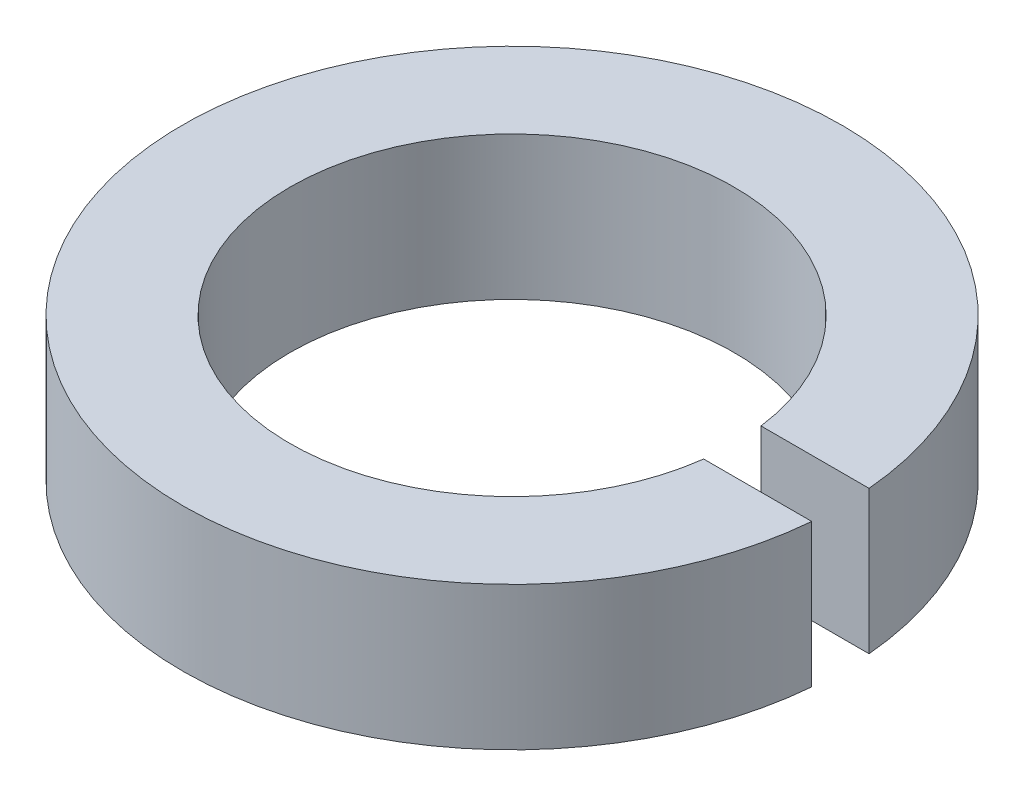
ISO-10303-21;
HEADER;
FILE_DESCRIPTION(('STEP AP214'),'2;1');
FILE_NAME('part.step','',(''),(''),'','','');
FILE_SCHEMA(('AUTOMOTIVE_DESIGN { 1 0 10303 214 1 1 1 1 }'));
ENDSEC;
DATA;
#1=APPLICATION_CONTEXT('core data for automotive mechanical design processes');
#2=APPLICATION_PROTOCOL_DEFINITION('international standard','automotive_design',2000,#1);
#3=PRODUCT_CONTEXT('',#1,'mechanical');
#4=PRODUCT('Part','Part','',(#3));
#5=PRODUCT_RELATED_PRODUCT_CATEGORY('part','',(#4));
#6=PRODUCT_DEFINITION_FORMATION('','',#4);
#7=PRODUCT_DEFINITION_CONTEXT('part definition',#1,'design');
#8=PRODUCT_DEFINITION('design','',#6,#7);
#9=PRODUCT_DEFINITION_SHAPE('','',#8);
#10=(LENGTH_UNIT() NAMED_UNIT(*) SI_UNIT(.MILLI.,.METRE.));
#11=(NAMED_UNIT(*) PLANE_ANGLE_UNIT() SI_UNIT($,.RADIAN.));
#12=(NAMED_UNIT(*) SI_UNIT($,.STERADIAN.) SOLID_ANGLE_UNIT());
#13=UNCERTAINTY_MEASURE_WITH_UNIT(LENGTH_MEASURE(1.E-05),#10,'distance_accuracy_value','');
#14=(GEOMETRIC_REPRESENTATION_CONTEXT(3) GLOBAL_UNCERTAINTY_ASSIGNED_CONTEXT((#13)) GLOBAL_UNIT_ASSIGNED_CONTEXT((#10,
#11,#12)) REPRESENTATION_CONTEXT('',''));
#15=CARTESIAN_POINT('',(0.,0.,0.));
#16=DIRECTION('',(0.,0.,1.));
#17=DIRECTION('',(1.,0.,0.));
#18=AXIS2_PLACEMENT_3D('',#15,#16,#17);
#19=CARTESIAN_POINT('',(0.,0.,0.));
#20=DIRECTION('',(0.,1.,0.));
#21=DIRECTION('',(0.,0.,1.));
#22=AXIS2_PLACEMENT_3D('',#19,#20,#21);
#23=PLANE('',#22);
#24=DIRECTION('',(-1.,0.,0.));
#25=VECTOR('',#24,1.);
#26=CARTESIAN_POINT('',(1.,0.,-0.2));
#27=LINE('',#26,#25);
#28=CARTESIAN_POINT('',(2.29128784747792,0.,-0.2));
#29=VERTEX_POINT('',#28);
#30=CARTESIAN_POINT('',(1.53704261489394,0.,-0.2));
#31=VERTEX_POINT('',#30);
#32=EDGE_CURVE('E59',#29,#31,#27,.T.);
#33=ORIENTED_EDGE('',*,*,#32,.T.);
#34=CARTESIAN_POINT('',(0.,0.,0.));
#35=DIRECTION('',(0.,-1.,0.));
#36=DIRECTION('',(0.,0.,-1.));
#37=AXIS2_PLACEMENT_3D('',#34,#35,#36);
#38=CIRCLE('',#37,1.55);
#39=CARTESIAN_POINT('',(1.53704261489394,0.,0.2));
#40=VERTEX_POINT('',#39);
#41=EDGE_CURVE('E82',#31,#40,#38,.F.);
#42=ORIENTED_EDGE('',*,*,#41,.T.);
#43=DIRECTION('',(1.,0.,0.));
#44=VECTOR('',#43,1.);
#45=CARTESIAN_POINT('',(1.,0.,0.2));
#46=LINE('',#45,#44);
#47=CARTESIAN_POINT('',(2.29128784747792,0.,0.2));
#48=VERTEX_POINT('',#47);
#49=EDGE_CURVE('E61',#40,#48,#46,.T.);
#50=ORIENTED_EDGE('',*,*,#49,.T.);
#51=CARTESIAN_POINT('',(0.,0.,0.));
#52=DIRECTION('',(0.,-1.,0.));
#53=DIRECTION('',(0.,0.,-1.));
#54=AXIS2_PLACEMENT_3D('',#51,#52,#53);
#55=CIRCLE('',#54,2.3);
#56=EDGE_CURVE('E20',#29,#48,#55,.F.);
#57=ORIENTED_EDGE('',*,*,#56,.F.);
#58=EDGE_LOOP('',(#33,#42,#50,#57));
#59=FACE_BOUND('',#58,.T.);
#60=ADVANCED_FACE('F17',(#59),#23,.F.);
#61=CARTESIAN_POINT('',(1.,0.,-0.2));
#62=DIRECTION('',(0.,0.,-1.));
#63=DIRECTION('',(-1.,0.,0.));
#64=AXIS2_PLACEMENT_3D('',#61,#62,#63);
#65=PLANE('',#64);
#66=DIRECTION('',(0.,-1.,0.));
#67=VECTOR('',#66,1.);
#68=CARTESIAN_POINT('',(1.53704261489394,1.,-0.2));
#69=LINE('',#68,#67);
#70=CARTESIAN_POINT('',(1.53704261489394,1.,-0.2));
#71=VERTEX_POINT('',#70);
#72=EDGE_CURVE('E70',#71,#31,#69,.T.);
#73=ORIENTED_EDGE('',*,*,#72,.T.);
#74=ORIENTED_EDGE('',*,*,#32,.F.);
#75=DIRECTION('',(0.,-1.,0.));
#76=VECTOR('',#75,1.);
#77=CARTESIAN_POINT('',(2.29128784747792,1.,-0.2));
#78=LINE('',#77,#76);
#79=CARTESIAN_POINT('',(2.29128784747792,1.,-0.2));
#80=VERTEX_POINT('',#79);
#81=EDGE_CURVE('E64',#80,#29,#78,.T.);
#82=ORIENTED_EDGE('',*,*,#81,.F.);
#83=DIRECTION('',(1.,0.,0.));
#84=VECTOR('',#83,1.);
#85=CARTESIAN_POINT('',(0.,1.,-0.2));
#86=LINE('',#85,#84);
#87=EDGE_CURVE('E81',#71,#80,#86,.T.);
#88=ORIENTED_EDGE('',*,*,#87,.F.);
#89=EDGE_LOOP('',(#73,#74,#82,#88));
#90=FACE_BOUND('',#89,.T.);
#91=ADVANCED_FACE('F66',(#90),#65,.F.);
#92=CARTESIAN_POINT('',(0.,1.,0.));
#93=DIRECTION('',(0.,-1.,0.));
#94=DIRECTION('',(0.,0.,-1.));
#95=AXIS2_PLACEMENT_3D('',#92,#93,#94);
#96=CYLINDRICAL_SURFACE('',#95,2.3);
#97=ORIENTED_EDGE('',*,*,#56,.T.);
#98=DIRECTION('',(0.,1.,0.));
#99=VECTOR('',#98,1.);
#100=CARTESIAN_POINT('',(2.29128784747792,0.,0.2));
#101=LINE('',#100,#99);
#102=CARTESIAN_POINT('',(2.29128784747792,1.,0.2));
#103=VERTEX_POINT('',#102);
#104=EDGE_CURVE('E63',#48,#103,#101,.T.);
#105=ORIENTED_EDGE('',*,*,#104,.T.);
#106=CARTESIAN_POINT('',(0.,1.,0.));
#107=DIRECTION('',(0.,-1.,0.));
#108=DIRECTION('',(0.,0.,-1.));
#109=AXIS2_PLACEMENT_3D('',#106,#107,#108);
#110=CIRCLE('',#109,2.3);
#111=EDGE_CURVE('E74',#80,#103,#110,.F.);
#112=ORIENTED_EDGE('',*,*,#111,.F.);
#113=ORIENTED_EDGE('',*,*,#81,.T.);
#114=EDGE_LOOP('',(#97,#105,#112,#113));
#115=FACE_BOUND('',#114,.T.);
#116=ADVANCED_FACE('F73',(#115),#96,.T.);
#117=CARTESIAN_POINT('',(1.,0.,0.2));
#118=DIRECTION('',(0.,0.,1.));
#119=DIRECTION('',(1.,0.,0.));
#120=AXIS2_PLACEMENT_3D('',#117,#118,#119);
#121=PLANE('',#120);
#122=DIRECTION('',(0.,-1.,0.));
#123=VECTOR('',#122,1.);
#124=CARTESIAN_POINT('',(1.53704261489394,1.,0.2));
#125=LINE('',#124,#123);
#126=CARTESIAN_POINT('',(1.53704261489394,1.,0.2));
#127=VERTEX_POINT('',#126);
#128=EDGE_CURVE('E35',#40,#127,#125,.F.);
#129=ORIENTED_EDGE('',*,*,#128,.T.);
#130=DIRECTION('',(1.,0.,0.));
#131=VECTOR('',#130,1.);
#132=CARTESIAN_POINT('',(0.,1.,0.2));
#133=LINE('',#132,#131);
#134=EDGE_CURVE('E26',#103,#127,#133,.F.);
#135=ORIENTED_EDGE('',*,*,#134,.F.);
#136=ORIENTED_EDGE('',*,*,#104,.F.);
#137=ORIENTED_EDGE('',*,*,#49,.F.);
#138=EDGE_LOOP('',(#129,#135,#136,#137));
#139=FACE_BOUND('',#138,.T.);
#140=ADVANCED_FACE('F89',(#139),#121,.F.);
#141=CARTESIAN_POINT('',(0.,1.,0.));
#142=DIRECTION('',(0.,-1.,0.));
#143=DIRECTION('',(0.,0.,-1.));
#144=AXIS2_PLACEMENT_3D('',#141,#142,#143);
#145=CYLINDRICAL_SURFACE('',#144,1.55);
#146=ORIENTED_EDGE('',*,*,#72,.F.);
#147=CARTESIAN_POINT('',(0.,1.,0.));
#148=DIRECTION('',(0.,-1.,0.));
#149=DIRECTION('',(0.,0.,-1.));
#150=AXIS2_PLACEMENT_3D('',#147,#148,#149);
#151=CIRCLE('',#150,1.55);
#152=EDGE_CURVE('E10',#127,#71,#151,.T.);
#153=ORIENTED_EDGE('',*,*,#152,.F.);
#154=ORIENTED_EDGE('',*,*,#128,.F.);
#155=ORIENTED_EDGE('',*,*,#41,.F.);
#156=EDGE_LOOP('',(#146,#153,#154,#155));
#157=FACE_BOUND('',#156,.T.);
#158=ADVANCED_FACE('F91',(#157),#145,.F.);
#159=CARTESIAN_POINT('',(0.,1.,0.));
#160=DIRECTION('',(0.,1.,0.));
#161=DIRECTION('',(0.,0.,1.));
#162=AXIS2_PLACEMENT_3D('',#159,#160,#161);
#163=PLANE('',#162);
#164=ORIENTED_EDGE('',*,*,#152,.T.);
#165=ORIENTED_EDGE('',*,*,#87,.T.);
#166=ORIENTED_EDGE('',*,*,#111,.T.);
#167=ORIENTED_EDGE('',*,*,#134,.T.);
#168=EDGE_LOOP('',(#164,#165,#166,#167));
#169=FACE_BOUND('',#168,.T.);
#170=ADVANCED_FACE('F88',(#169),#163,.T.);
#171=CLOSED_SHELL('',(#60,#91,#116,#140,#158,#170));
#172=MANIFOLD_SOLID_BREP('B1',#171);
#173=ADVANCED_BREP_SHAPE_REPRESENTATION('',(#18,#172),#14);
#174=SHAPE_DEFINITION_REPRESENTATION(#9,#173);
ENDSEC;
END-ISO-10303-21;
